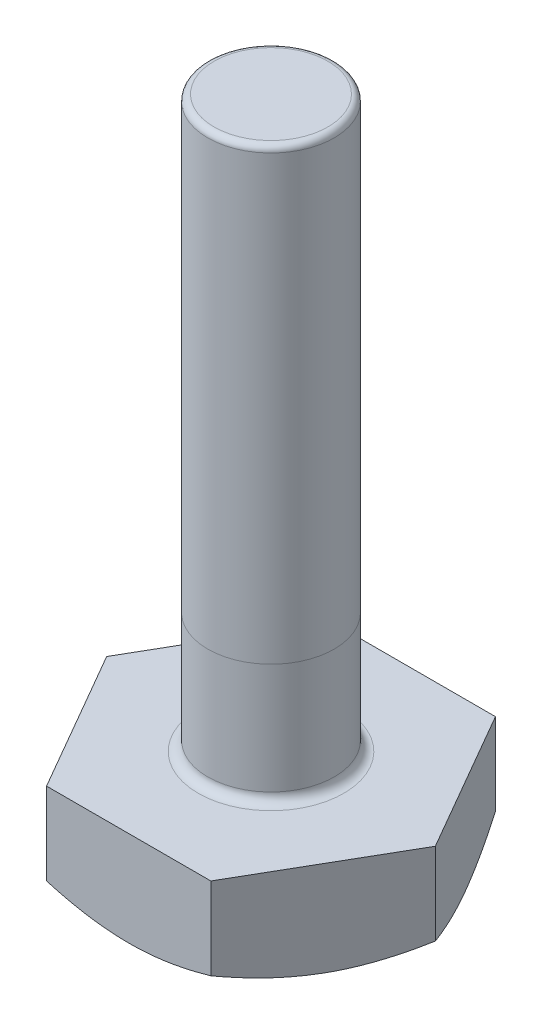
ISO-10303-21;
HEADER;
FILE_DESCRIPTION(('STEP AP214'),'2;1');
FILE_NAME('part.step','',(''),(''),'','','');
FILE_SCHEMA(('AUTOMOTIVE_DESIGN { 1 0 10303 214 1 1 1 1 }'));
ENDSEC;
DATA;
#1=APPLICATION_CONTEXT('core data for automotive mechanical design processes');
#2=APPLICATION_PROTOCOL_DEFINITION('international standard','automotive_design',2000,#1);
#3=PRODUCT_CONTEXT('',#1,'mechanical');
#4=PRODUCT('Part','Part','',(#3));
#5=PRODUCT_RELATED_PRODUCT_CATEGORY('part','',(#4));
#6=PRODUCT_DEFINITION_FORMATION('','',#4);
#7=PRODUCT_DEFINITION_CONTEXT('part definition',#1,'design');
#8=PRODUCT_DEFINITION('design','',#6,#7);
#9=PRODUCT_DEFINITION_SHAPE('','',#8);
#10=(LENGTH_UNIT() NAMED_UNIT(*) SI_UNIT(.MILLI.,.METRE.));
#11=(NAMED_UNIT(*) PLANE_ANGLE_UNIT() SI_UNIT($,.RADIAN.));
#12=(NAMED_UNIT(*) SI_UNIT($,.STERADIAN.) SOLID_ANGLE_UNIT());
#13=UNCERTAINTY_MEASURE_WITH_UNIT(LENGTH_MEASURE(1.E-05),#10,'distance_accuracy_value','');
#14=(GEOMETRIC_REPRESENTATION_CONTEXT(3) GLOBAL_UNCERTAINTY_ASSIGNED_CONTEXT((#13)) GLOBAL_UNIT_ASSIGNED_CONTEXT((#10,
#11,#12)) REPRESENTATION_CONTEXT('',''));
#15=CARTESIAN_POINT('',(0.,0.,0.));
#16=DIRECTION('',(0.,0.,1.));
#17=DIRECTION('',(1.,0.,0.));
#18=AXIS2_PLACEMENT_3D('',#15,#16,#17);
#19=CARTESIAN_POINT('',(0.,10.5,0.));
#20=DIRECTION('',(0.,-1.,0.));
#21=DIRECTION('',(0.,0.,-1.));
#22=AXIS2_PLACEMENT_3D('',#19,#20,#21);
#23=CYLINDRICAL_SURFACE('',#22,1.);
#24=CARTESIAN_POINT('',(0.,1.65,0.));
#25=DIRECTION('',(0.,1.,0.));
#26=DIRECTION('',(0.,0.,1.));
#27=AXIS2_PLACEMENT_3D('',#24,#25,#26);
#28=CIRCLE('',#27,1.);
#29=CARTESIAN_POINT('',(0.,1.65,1.));
#30=VERTEX_POINT('',#29);
#31=EDGE_CURVE('E265',#30,#30,#28,.T.);
#32=ORIENTED_EDGE('',*,*,#31,.T.);
#33=EDGE_LOOP('',(#32));
#34=FACE_BOUND('',#33,.T.);
#35=CARTESIAN_POINT('',(0.,3.4,0.));
#36=DIRECTION('',(0.,1.,0.));
#37=DIRECTION('',(0.,0.,1.));
#38=AXIS2_PLACEMENT_3D('',#35,#36,#37);
#39=CIRCLE('',#38,1.);
#40=CARTESIAN_POINT('',(0.,3.4,1.));
#41=VERTEX_POINT('',#40);
#42=EDGE_CURVE('E13',#41,#41,#39,.T.);
#43=ORIENTED_EDGE('',*,*,#42,.F.);
#44=EDGE_LOOP('',(#43));
#45=FACE_BOUND('',#44,.T.);
#46=ADVANCED_FACE('F59',(#34,#45),#23,.T.);
#47=CARTESIAN_POINT('',(1.29903810567666,1.5,2.25));
#48=DIRECTION('',(-0.866025403784439,0.,-0.5));
#49=DIRECTION('',(-0.5,0.,0.866025403784439));
#50=AXIS2_PLACEMENT_3D('',#47,#48,#49);
#51=PLANE('',#50);
#52=DIRECTION('',(0.,-1.,0.));
#53=VECTOR('',#52,1.);
#54=CARTESIAN_POINT('',(1.29903810567666,1.5,2.25));
#55=LINE('',#54,#53);
#56=CARTESIAN_POINT('',(1.29903810567666,1.5,2.25));
#57=VERTEX_POINT('',#56);
#58=CARTESIAN_POINT('',(1.29903810567666,0.200961894323341,2.25));
#59=VERTEX_POINT('',#58);
#60=EDGE_CURVE('E163',#57,#59,#55,.T.);
#61=ORIENTED_EDGE('',*,*,#60,.T.);
#62=CARTESIAN_POINT('',(1.29892263562282,0.201028565434254,2.2502));
#63=CARTESIAN_POINT('',(1.35600944184252,0.168055578047864,2.15132275118564));
#64=CARTESIAN_POINT('',(1.41358901625738,0.138067535415598,2.05159200282091));
#65=CARTESIAN_POINT('',(1.52974527574028,0.0857223882308779,1.85040345977937));
#66=CARTESIAN_POINT('',(1.58832402518513,0.0633838027064785,1.74894208949705));
#67=CARTESIAN_POINT('',(1.7047555284741,0.0286095576734187,1.54727681019892));
#68=CARTESIAN_POINT('',(1.76259036492223,0.0159424738337181,1.44710393502333));
#69=CARTESIAN_POINT('',(1.87853225689702,0.000818907417418704,1.24628668739732));
#70=CARTESIAN_POINT('',(1.93663889083104,-0.00165009697600156,1.1456430451668));
#71=CARTESIAN_POINT('',(2.04522012232352,0.00347837463602913,0.957574835473434));
#72=CARTESIAN_POINT('',(2.09571095029608,0.00981663451511996,0.870122156108741));
#73=CARTESIAN_POINT('',(2.19636364908279,0.0299076571898886,0.695786567891225));
#74=CARTESIAN_POINT('',(2.24652517159694,0.0436672872310833,0.608904262311711));
#75=CARTESIAN_POINT('',(2.34738550181938,0.0780662653506652,0.434209045898264));
#76=CARTESIAN_POINT('',(2.39807153998286,0.098851471582655,0.346418252564746));
#77=CARTESIAN_POINT('',(2.49868751999961,0.146026087362979,0.172146263122404));
#78=CARTESIAN_POINT('',(2.54861875151746,0.172404408014301,0.085662833248997));
#79=CARTESIAN_POINT('',(2.59819168140715,0.201028565434254,-0.000200000000000381));
#80=B_SPLINE_CURVE_WITH_KNOTS('',3,(#62,#63,#64,#65,#66,#67,#68,#69,#70,#71,#72,#73,#74,#75,#76,
#77,#78,#79),.UNSPECIFIED.,.F.,.F.,(4,2,2,2,2,2,2,2,4),(0.,0.356658826016552,0.714175103224236,
1.06284241804968,1.41108149062516,1.71433394539794,2.01786749258222,2.32813511279245,
2.63779325460359),.UNSPECIFIED.);
#81=CARTESIAN_POINT('',(1.94855715851499,0.,1.125));
#82=VERTEX_POINT('',#81);
#83=EDGE_CURVE('E82',#59,#82,#80,.T.);
#84=ORIENTED_EDGE('',*,*,#83,.T.);
#85=CARTESIAN_POINT('',(2.59807621135332,0.200961894323341,0.));
#86=VERTEX_POINT('',#85);
#87=EDGE_CURVE('E132',#82,#86,#80,.T.);
#88=ORIENTED_EDGE('',*,*,#87,.T.);
#89=DIRECTION('',(0.,-1.,0.));
#90=VECTOR('',#89,1.);
#91=CARTESIAN_POINT('',(2.59807621135332,1.5,0.));
#92=LINE('',#91,#90);
#93=CARTESIAN_POINT('',(2.59807621135332,1.5,0.));
#94=VERTEX_POINT('',#93);
#95=EDGE_CURVE('E157',#94,#86,#92,.T.);
#96=ORIENTED_EDGE('',*,*,#95,.F.);
#97=DIRECTION('',(0.5,0.,-0.866025403784439));
#98=VECTOR('',#97,1.);
#99=CARTESIAN_POINT('',(1.29903810567666,1.5,2.25));
#100=LINE('',#99,#98);
#101=EDGE_CURVE('E165',#57,#94,#100,.T.);
#102=ORIENTED_EDGE('',*,*,#101,.F.);
#103=EDGE_LOOP('',(#61,#84,#88,#96,#102));
#104=FACE_BOUND('',#103,.T.);
#105=ADVANCED_FACE('F160',(#104),#51,.F.);
#106=CARTESIAN_POINT('',(2.59807621135332,1.5,0.));
#107=DIRECTION('',(-0.866025403784439,0.,0.5));
#108=DIRECTION('',(0.5,0.,0.866025403784439));
#109=AXIS2_PLACEMENT_3D('',#106,#107,#108);
#110=PLANE('',#109);
#111=ORIENTED_EDGE('',*,*,#95,.T.);
#112=CARTESIAN_POINT('',(2.59819168140715,0.201028565434254,0.000199999999999357));
#113=CARTESIAN_POINT('',(2.54110487518745,0.168055578047863,-0.098677248814358));
#114=CARTESIAN_POINT('',(2.48352530077259,0.138067535415598,-0.198407997179094));
#115=CARTESIAN_POINT('',(2.36736904128969,0.0857223882308776,-0.399596540220633));
#116=CARTESIAN_POINT('',(2.30879029184485,0.0633838027064784,-0.501057910502946));
#117=CARTESIAN_POINT('',(2.19235878855587,0.0286095576734187,-0.702723189801079));
#118=CARTESIAN_POINT('',(2.13452395210774,0.0159424738337182,-0.802896064976672));
#119=CARTESIAN_POINT('',(2.01858206013295,0.000818907417418827,-1.00371331260268));
#120=CARTESIAN_POINT('',(1.96047542619893,-0.00165009697600156,-1.1043569548332));
#121=CARTESIAN_POINT('',(1.85189419470646,0.00347837463602913,-1.29242516452657));
#122=CARTESIAN_POINT('',(1.8014033667339,0.00981663451512006,-1.37987784389126));
#123=CARTESIAN_POINT('',(1.70075066794718,0.0299076571898888,-1.55421343210877));
#124=CARTESIAN_POINT('',(1.65058914543304,0.0436672872310834,-1.64109573768829));
#125=CARTESIAN_POINT('',(1.54972881521059,0.0780662653506654,-1.81579095410174));
#126=CARTESIAN_POINT('',(1.49904277704711,0.0988514715826554,-1.90358174743525));
#127=CARTESIAN_POINT('',(1.39842679703037,0.146026087362979,-2.07785373687759));
#128=CARTESIAN_POINT('',(1.34849556551251,0.172404408014302,-2.164337166751));
#129=CARTESIAN_POINT('',(1.29892263562282,0.201028565434254,-2.2502));
#130=B_SPLINE_CURVE_WITH_KNOTS('',3,(#112,#113,#114,#115,#116,#117,#118,#119,#120,#121,#122,
#123,#124,#125,#126,#127,#128,#129),.UNSPECIFIED.,.F.,.F.,(4,2,2,2,2,2,2,2,4),(0.,
0.356658826016552,0.714175103224236,1.06284241804968,1.41108149062516,1.71433394539794,
2.01786749258222,2.32813511279245,2.63779325460359),.UNSPECIFIED.);
#131=CARTESIAN_POINT('',(1.94855715851499,0.,-1.125));
#132=VERTEX_POINT('',#131);
#133=EDGE_CURVE('E138',#86,#132,#130,.T.);
#134=ORIENTED_EDGE('',*,*,#133,.T.);
#135=CARTESIAN_POINT('',(1.29903810567666,0.200961894323341,-2.25));
#136=VERTEX_POINT('',#135);
#137=EDGE_CURVE('E177',#132,#136,#130,.T.);
#138=ORIENTED_EDGE('',*,*,#137,.T.);
#139=DIRECTION('',(0.,-1.,0.));
#140=VECTOR('',#139,1.);
#141=CARTESIAN_POINT('',(1.29903810567666,1.5,-2.25));
#142=LINE('',#141,#140);
#143=CARTESIAN_POINT('',(1.29903810567666,1.5,-2.25));
#144=VERTEX_POINT('',#143);
#145=EDGE_CURVE('E405',#144,#136,#142,.T.);
#146=ORIENTED_EDGE('',*,*,#145,.F.);
#147=DIRECTION('',(-0.5,0.,-0.866025403784438));
#148=VECTOR('',#147,1.);
#149=CARTESIAN_POINT('',(2.59807621135332,1.5,0.));
#150=LINE('',#149,#148);
#151=EDGE_CURVE('E168',#94,#144,#150,.T.);
#152=ORIENTED_EDGE('',*,*,#151,.F.);
#153=EDGE_LOOP('',(#111,#134,#138,#146,#152));
#154=FACE_BOUND('',#153,.T.);
#155=ADVANCED_FACE('F234',(#154),#110,.F.);
#156=CARTESIAN_POINT('',(1.29903810567666,1.5,-2.25));
#157=DIRECTION('',(0.,0.,1.));
#158=DIRECTION('',(1.,0.,0.));
#159=AXIS2_PLACEMENT_3D('',#156,#157,#158);
#160=PLANE('',#159);
#161=ORIENTED_EDGE('',*,*,#145,.T.);
#162=CARTESIAN_POINT('',(-3.52197738141251,1.11390095110183,-2.25));
#163=CARTESIAN_POINT('',(-3.42341375827664,1.0659585756218,-2.25));
#164=CARTESIAN_POINT('',(-3.32462732046674,1.01846660292519,-2.25));
#165=CARTESIAN_POINT('',(-3.12649042155675,0.924636184761063,-2.25));
#166=CARTESIAN_POINT('',(-3.0271398773449,0.878297914989038,-2.25));
#167=CARTESIAN_POINT('',(-2.82726011968439,0.786801502375653,-2.25));
#168=CARTESIAN_POINT('',(-2.72672745294232,0.741650877991985,-2.25));
#169=CARTESIAN_POINT('',(-2.52487369382336,0.653154685540231,-2.25));
#170=CARTESIAN_POINT('',(-2.42355263804854,0.609809034260195,-2.25));
#171=CARTESIAN_POINT('',(-2.21659476271895,0.524002667690954,-2.25));
#172=CARTESIAN_POINT('',(-2.11092600192723,0.48161857996588,-2.25));
#173=CARTESIAN_POINT('',(-1.89836438450428,0.39997997327036,-2.25));
#174=CARTESIAN_POINT('',(-1.79147139383765,0.360725800799589,-2.25));
#175=CARTESIAN_POINT('',(-1.57648088714343,0.286353481784259,-2.25));
#176=CARTESIAN_POINT('',(-1.46838619801085,0.251227243931005,-2.25));
#177=CARTESIAN_POINT('',(-1.25064660418042,0.186216235284175,-2.25));
#178=CARTESIAN_POINT('',(-1.14100218878383,0.156329848348454,-2.25));
#179=CARTESIAN_POINT('',(-0.92070201849629,0.103368352938566,-2.25));
#180=CARTESIAN_POINT('',(-0.810055393150088,0.0802559587867579,-2.25));
#181=CARTESIAN_POINT('',(-0.587352764653864,0.0421303854829852,-2.25));
#182=CARTESIAN_POINT('',(-0.47529691042668,0.027116357759959,-2.25));
#183=CARTESIAN_POINT('',(-0.251812929194183,0.00658034974223085,-2.25));
#184=CARTESIAN_POINT('',(-0.14039654239679,0.000933753367218394,-2.25));
#185=CARTESIAN_POINT('',(0.0825190683366311,-0.000718872330041224,-2.25));
#186=CARTESIAN_POINT('',(0.194018293833792,0.00327528488856826,-2.25));
#187=CARTESIAN_POINT('',(0.382330142880849,0.0178769534924864,-2.25));
#188=CARTESIAN_POINT('',(0.459340397363023,0.0260932396846655,-2.25));
#189=CARTESIAN_POINT('',(0.612816753345091,0.0466307384415177,-2.25));
#190=CARTESIAN_POINT('',(0.689282783381976,0.0589524803012809,-2.25));
#191=CARTESIAN_POINT('',(0.917739348520181,0.101432117313602,-2.25));
#192=CARTESIAN_POINT('',(1.06870971539403,0.137097502133778,-2.25));
#193=CARTESIAN_POINT('',(1.37103680360794,0.220180172187129,-2.25));
#194=CARTESIAN_POINT('',(1.52232103264969,0.267851205926124,-2.25));
#195=CARTESIAN_POINT('',(1.74714070039569,0.345287132446791,-2.25));
#196=CARTESIAN_POINT('',(1.82172326340421,0.372084822292635,-2.25));
#197=CARTESIAN_POINT('',(1.97026726128439,0.427347472066698,-2.25));
#198=CARTESIAN_POINT('',(2.04422870882023,0.455812397906081,-2.25));
#199=CARTESIAN_POINT('',(2.23860492044926,0.53272916106023,-2.25));
#200=CARTESIAN_POINT('',(2.35855685866881,0.582348052655542,-2.25));
#201=CARTESIAN_POINT('',(2.59726926616986,0.684383302621109,-2.25));
#202=CARTESIAN_POINT('',(2.71602961917634,0.736799930900864,-2.25));
#203=CARTESIAN_POINT('',(2.95261997022605,0.843783458085284,-2.25));
#204=CARTESIAN_POINT('',(3.07044966156159,0.898351033044894,-2.25));
#205=CARTESIAN_POINT('',(3.30532803773282,1.00914490838146,-2.25));
#206=CARTESIAN_POINT('',(3.42237670029077,1.06537125582663,-2.25));
#207=CARTESIAN_POINT('',(3.772918226205,1.23615148283883,-2.25));
#208=CARTESIAN_POINT('',(4.00546324926994,1.35264855901626,-2.25));
#209=CARTESIAN_POINT('',(4.46880936717424,1.58892913990386,-2.25));
#210=CARTESIAN_POINT('',(4.69961078337091,1.70871201919371,-2.25));
#211=CARTESIAN_POINT('',(5.13664821519431,1.93826026257468,-2.25));
#212=CARTESIAN_POINT('',(5.34299887018508,2.04780774589485,-2.25));
#213=CARTESIAN_POINT('',(5.75499613846858,2.26824392733038,-2.25));
#214=CARTESIAN_POINT('',(5.96064271189639,2.37913269982908,-2.25));
#215=CARTESIAN_POINT('',(6.37074349624387,2.60155716847679,-2.25));
#216=CARTESIAN_POINT('',(6.57519942113759,2.71308970822725,-2.25));
#217=CARTESIAN_POINT('',(6.98367055464051,2.93692385932281,-2.25));
#218=CARTESIAN_POINT('',(7.18768579443994,3.04922541372586,-2.25));
#219=CARTESIAN_POINT('',(7.39154490642063,3.16180770738138,-2.25));
#220=B_SPLINE_CURVE_WITH_KNOTS('',3,(#162,#163,#164,#165,#166,#167,#168,#169,#170,#171,#172,
#173,#174,#175,#176,#177,#178,#179,#180,#181,#182,#183,#184,#185,#186,#187,#188,#189,#190,#191,
#192,#193,#194,#195,#196,#197,#198,#199,#200,#201,#202,#203,#204,#205,#206,#207,#208,#209,#210,
#211,#212,#213,#214,#215,#216,#217,#218,#219),.UNSPECIFIED.,.F.,.F.,(4,2,2,2,2,2,2,2,2,2,2,2,2,
2,2,2,2,2,2,2,2,2,2,2,2,2,2,2,4),(0.,0.328818908084942,0.657687588893984,0.988291819795509,
1.31888079243726,1.66039871580695,2.00195439483825,2.34282899905692,2.68359828068235,
3.02245505769599,3.36127632138179,3.69555296053218,4.02983606771951,4.26206695892987,
4.49432780205634,4.95908522051656,5.43463886514895,5.67237551107399,5.91010729785594,
6.29948456778213,6.68889947071941,7.07843776050616,7.46798711422164,8.24821946544531,
9.02830432372208,9.72917646139023,10.4300876468841,11.1287814424384,11.8274240505439),.UNSPECIFIED.);
#221=CARTESIAN_POINT('',(0.,0.,-2.25));
#222=VERTEX_POINT('',#221);
#223=EDGE_CURVE('E228',#136,#222,#220,.F.);
#224=ORIENTED_EDGE('',*,*,#223,.T.);
#225=CARTESIAN_POINT('',(-1.29903810567666,0.200961894323341,-2.25));
#226=VERTEX_POINT('',#225);
#227=EDGE_CURVE('E220',#222,#226,#220,.F.);
#228=ORIENTED_EDGE('',*,*,#227,.T.);
#229=DIRECTION('',(0.,-1.,0.));
#230=VECTOR('',#229,1.);
#231=CARTESIAN_POINT('',(-1.29903810567666,1.5,-2.25));
#232=LINE('',#231,#230);
#233=CARTESIAN_POINT('',(-1.29903810567666,1.5,-2.25));
#234=VERTEX_POINT('',#233);
#235=EDGE_CURVE('E399',#234,#226,#232,.T.);
#236=ORIENTED_EDGE('',*,*,#235,.F.);
#237=DIRECTION('',(-1.,0.,0.));
#238=VECTOR('',#237,1.);
#239=CARTESIAN_POINT('',(1.29903810567666,1.5,-2.25));
#240=LINE('',#239,#238);
#241=EDGE_CURVE('E450',#144,#234,#240,.T.);
#242=ORIENTED_EDGE('',*,*,#241,.F.);
#243=EDGE_LOOP('',(#161,#224,#228,#236,#242));
#244=FACE_BOUND('',#243,.T.);
#245=ADVANCED_FACE('F230',(#244),#160,.F.);
#246=CARTESIAN_POINT('',(-1.29903810567666,1.5,-2.25));
#247=DIRECTION('',(0.866025403784439,0.,0.5));
#248=DIRECTION('',(0.5,0.,-0.866025403784439));
#249=AXIS2_PLACEMENT_3D('',#246,#247,#248);
#250=PLANE('',#249);
#251=ORIENTED_EDGE('',*,*,#235,.T.);
#252=CARTESIAN_POINT('',(-1.29892263562282,0.201028565434254,-2.2502));
#253=CARTESIAN_POINT('',(-1.35600944184252,0.168055578047864,-2.15132275118564));
#254=CARTESIAN_POINT('',(-1.41358901625738,0.138067535415598,-2.05159200282091));
#255=CARTESIAN_POINT('',(-1.52974527574028,0.0857223882308779,-1.85040345977937));
#256=CARTESIAN_POINT('',(-1.58832402518513,0.0633838027064784,-1.74894208949705));
#257=CARTESIAN_POINT('',(-1.7047555284741,0.0286095576734186,-1.54727681019892));
#258=CARTESIAN_POINT('',(-1.76259036492223,0.0159424738337182,-1.44710393502333));
#259=CARTESIAN_POINT('',(-1.87853225689702,0.000818907417418833,-1.24628668739732));
#260=CARTESIAN_POINT('',(-1.93663889083104,-0.00165009697600149,-1.1456430451668));
#261=CARTESIAN_POINT('',(-2.04522012232352,0.00347837463602918,-0.957574835473435));
#262=CARTESIAN_POINT('',(-2.09571095029608,0.00981663451512005,-0.870122156108742));
#263=CARTESIAN_POINT('',(-2.19636364908279,0.0299076571898888,-0.695786567891226));
#264=CARTESIAN_POINT('',(-2.24652517159694,0.0436672872310835,-0.608904262311712));
#265=CARTESIAN_POINT('',(-2.34738550181938,0.0780662653506654,-0.434209045898264));
#266=CARTESIAN_POINT('',(-2.39807153998286,0.0988514715826553,-0.346418252564746));
#267=CARTESIAN_POINT('',(-2.49868751999961,0.146026087362979,-0.172146263122405));
#268=CARTESIAN_POINT('',(-2.54861875151746,0.172404408014302,-0.0856628332489976));
#269=CARTESIAN_POINT('',(-2.59819168140715,0.201028565434255,0.000200000000000257));
#270=B_SPLINE_CURVE_WITH_KNOTS('',3,(#252,#253,#254,#255,#256,#257,#258,#259,#260,#261,#262,
#263,#264,#265,#266,#267,#268,#269),.UNSPECIFIED.,.F.,.F.,(4,2,2,2,2,2,2,2,4),(0.,
0.356658826016552,0.714175103224236,1.06284241804968,1.41108149062516,1.71433394539794,
2.01786749258222,2.32813511279245,2.63779325460359),.UNSPECIFIED.);
#271=CARTESIAN_POINT('',(-1.94855715851499,0.,-1.125));
#272=VERTEX_POINT('',#271);
#273=EDGE_CURVE('E229',#226,#272,#270,.T.);
#274=ORIENTED_EDGE('',*,*,#273,.T.);
#275=CARTESIAN_POINT('',(-2.59807621135332,0.200961894323341,0.));
#276=VERTEX_POINT('',#275);
#277=EDGE_CURVE('E214',#272,#276,#270,.T.);
#278=ORIENTED_EDGE('',*,*,#277,.T.);
#279=DIRECTION('',(0.,-1.,0.));
#280=VECTOR('',#279,1.);
#281=CARTESIAN_POINT('',(-2.59807621135332,1.5,0.));
#282=LINE('',#281,#280);
#283=CARTESIAN_POINT('',(-2.59807621135332,1.5,0.));
#284=VERTEX_POINT('',#283);
#285=EDGE_CURVE('E406',#284,#276,#282,.T.);
#286=ORIENTED_EDGE('',*,*,#285,.F.);
#287=DIRECTION('',(-0.5,0.,0.866025403784439));
#288=VECTOR('',#287,1.);
#289=CARTESIAN_POINT('',(-1.29903810567666,1.5,-2.25));
#290=LINE('',#289,#288);
#291=EDGE_CURVE('E402',#234,#284,#290,.T.);
#292=ORIENTED_EDGE('',*,*,#291,.F.);
#293=EDGE_LOOP('',(#251,#274,#278,#286,#292));
#294=FACE_BOUND('',#293,.T.);
#295=ADVANCED_FACE('F233',(#294),#250,.F.);
#296=CARTESIAN_POINT('',(-2.59807621135332,1.5,0.));
#297=DIRECTION('',(0.866025403784439,0.,-0.5));
#298=DIRECTION('',(-0.5,0.,-0.866025403784439));
#299=AXIS2_PLACEMENT_3D('',#296,#297,#298);
#300=PLANE('',#299);
#301=ORIENTED_EDGE('',*,*,#285,.T.);
#302=CARTESIAN_POINT('',(-2.59819168140715,0.201028565434254,-0.000199999999999883));
#303=CARTESIAN_POINT('',(-2.54110487518745,0.168055578047863,0.0986772488143573));
#304=CARTESIAN_POINT('',(-2.48352530077259,0.138067535415598,0.198407997179094));
#305=CARTESIAN_POINT('',(-2.36736904128969,0.0857223882308777,0.399596540220633));
#306=CARTESIAN_POINT('',(-2.30879029184485,0.0633838027064785,0.501057910502946));
#307=CARTESIAN_POINT('',(-2.19235878855587,0.0286095576734187,0.702723189801079));
#308=CARTESIAN_POINT('',(-2.13452395210774,0.0159424738337181,0.802896064976672));
#309=CARTESIAN_POINT('',(-2.01858206013295,0.00081890741741856,1.00371331260268));
#310=CARTESIAN_POINT('',(-1.96047542619893,-0.00165009697600183,1.1043569548332));
#311=CARTESIAN_POINT('',(-1.85189419470646,0.00347837463602913,1.29242516452657));
#312=CARTESIAN_POINT('',(-1.8014033667339,0.00981663451512028,1.37987784389126));
#313=CARTESIAN_POINT('',(-1.70075066794718,0.029907657189889,1.55421343210877));
#314=CARTESIAN_POINT('',(-1.65058914543304,0.0436672872310835,1.64109573768829));
#315=CARTESIAN_POINT('',(-1.54972881521059,0.0780662653506653,1.81579095410174));
#316=CARTESIAN_POINT('',(-1.49904277704711,0.0988514715826554,1.90358174743525));
#317=CARTESIAN_POINT('',(-1.39842679703037,0.146026087362979,2.0778537368776));
#318=CARTESIAN_POINT('',(-1.34849556551251,0.172404408014302,2.164337166751));
#319=CARTESIAN_POINT('',(-1.29892263562282,0.201028565434254,2.2502));
#320=B_SPLINE_CURVE_WITH_KNOTS('',3,(#302,#303,#304,#305,#306,#307,#308,#309,#310,#311,#312,
#313,#314,#315,#316,#317,#318,#319),.UNSPECIFIED.,.F.,.F.,(4,2,2,2,2,2,2,2,4),(0.,
0.356658826016552,0.714175103224236,1.06284241804968,1.41108149062516,1.71433394539794,
2.01786749258222,2.32813511279245,2.63779325460359),.UNSPECIFIED.);
#321=CARTESIAN_POINT('',(-1.94855715851499,0.,1.125));
#322=VERTEX_POINT('',#321);
#323=EDGE_CURVE('E458',#276,#322,#320,.T.);
#324=ORIENTED_EDGE('',*,*,#323,.T.);
#325=CARTESIAN_POINT('',(-1.29903810567683,0.200961894323226,2.25));
#326=VERTEX_POINT('',#325);
#327=EDGE_CURVE('E207',#322,#326,#320,.T.);
#328=ORIENTED_EDGE('',*,*,#327,.T.);
#329=DIRECTION('',(0.,-1.,0.));
#330=VECTOR('',#329,1.);
#331=CARTESIAN_POINT('',(-1.29903810567666,1.5,2.25));
#332=LINE('',#331,#330);
#333=CARTESIAN_POINT('',(-1.29903810567666,1.5,2.25));
#334=VERTEX_POINT('',#333);
#335=EDGE_CURVE('E413',#334,#326,#332,.T.);
#336=ORIENTED_EDGE('',*,*,#335,.F.);
#337=DIRECTION('',(0.5,0.,0.866025403784439));
#338=VECTOR('',#337,1.);
#339=CARTESIAN_POINT('',(-2.59807621135332,1.5,0.));
#340=LINE('',#339,#338);
#341=EDGE_CURVE('E437',#284,#334,#340,.T.);
#342=ORIENTED_EDGE('',*,*,#341,.F.);
#343=EDGE_LOOP('',(#301,#324,#328,#336,#342));
#344=FACE_BOUND('',#343,.T.);
#345=ADVANCED_FACE('F359',(#344),#300,.F.);
#346=CARTESIAN_POINT('',(-1.29903810567666,1.5,2.25));
#347=DIRECTION('',(0.,0.,-1.));
#348=DIRECTION('',(-1.,0.,0.));
#349=AXIS2_PLACEMENT_3D('',#346,#347,#348);
#350=PLANE('',#349);
#351=ORIENTED_EDGE('',*,*,#335,.T.);
#352=CARTESIAN_POINT('',(-3.5219773814125,1.11390095110183,2.25));
#353=CARTESIAN_POINT('',(-3.42341375827664,1.0659585756218,2.25));
#354=CARTESIAN_POINT('',(-3.32462732046674,1.01846660292519,2.25));
#355=CARTESIAN_POINT('',(-3.12649042155674,0.924636184761063,2.25));
#356=CARTESIAN_POINT('',(-3.02713987734489,0.878297914989037,2.25));
#357=CARTESIAN_POINT('',(-2.82726011968439,0.786801502375653,2.25));
#358=CARTESIAN_POINT('',(-2.72672745294232,0.741650877991985,2.25));
#359=CARTESIAN_POINT('',(-2.52487369382336,0.65315468554023,2.25));
#360=CARTESIAN_POINT('',(-2.42355263804854,0.609809034260194,2.25));
#361=CARTESIAN_POINT('',(-2.21659476271895,0.524002667690954,2.25));
#362=CARTESIAN_POINT('',(-2.11092600192723,0.48161857996588,2.25));
#363=CARTESIAN_POINT('',(-1.89836438450428,0.39997997327036,2.25));
#364=CARTESIAN_POINT('',(-1.79147139383765,0.360725800799589,2.25));
#365=CARTESIAN_POINT('',(-1.57648088714343,0.286353481784258,2.25));
#366=CARTESIAN_POINT('',(-1.46838619801085,0.251227243931004,2.25));
#367=CARTESIAN_POINT('',(-1.25064660418042,0.186216235284175,2.25));
#368=CARTESIAN_POINT('',(-1.14100218878383,0.156329848348454,2.25));
#369=CARTESIAN_POINT('',(-0.92070201849629,0.103368352938566,2.25));
#370=CARTESIAN_POINT('',(-0.810055393150088,0.0802559587867576,2.25));
#371=CARTESIAN_POINT('',(-0.587352764653863,0.042130385482985,2.25));
#372=CARTESIAN_POINT('',(-0.47529691042668,0.027116357759959,2.25));
#373=CARTESIAN_POINT('',(-0.251812929194182,0.00658034974223091,2.25));
#374=CARTESIAN_POINT('',(-0.14039654239679,0.00093375336721839,2.25));
#375=CARTESIAN_POINT('',(0.0825190683366311,-0.00071887233004122,2.25));
#376=CARTESIAN_POINT('',(0.194018293833792,0.00327528488856833,2.25));
#377=CARTESIAN_POINT('',(0.382330142880849,0.0178769534924863,2.25));
#378=CARTESIAN_POINT('',(0.459340397363022,0.0260932396846652,2.25));
#379=CARTESIAN_POINT('',(0.61281675334509,0.0466307384415174,2.25));
#380=CARTESIAN_POINT('',(0.689282783381975,0.0589524803012808,2.25));
#381=CARTESIAN_POINT('',(0.91773934852018,0.101432117313602,2.25));
#382=CARTESIAN_POINT('',(1.06870971539403,0.137097502133778,2.25));
#383=CARTESIAN_POINT('',(1.37103680360795,0.220180172187129,2.25));
#384=CARTESIAN_POINT('',(1.52232103264969,0.267851205926124,2.25));
#385=CARTESIAN_POINT('',(1.74714070039569,0.345287132446791,2.25));
#386=CARTESIAN_POINT('',(1.82172326340421,0.372084822292635,2.25));
#387=CARTESIAN_POINT('',(1.97026726128439,0.427347472066698,2.25));
#388=CARTESIAN_POINT('',(2.04422870882023,0.455812397906081,2.25));
#389=CARTESIAN_POINT('',(2.23860492044926,0.53272916106023,2.25));
#390=CARTESIAN_POINT('',(2.35855685866881,0.582348052655542,2.25));
#391=CARTESIAN_POINT('',(2.59726926616986,0.684383302621109,2.25));
#392=CARTESIAN_POINT('',(2.71602961917634,0.736799930900865,2.25));
#393=CARTESIAN_POINT('',(2.95261997022605,0.843783458085285,2.25));
#394=CARTESIAN_POINT('',(3.07044966156159,0.898351033044895,2.25));
#395=CARTESIAN_POINT('',(3.30532803773282,1.00914490838146,2.25));
#396=CARTESIAN_POINT('',(3.42237670029077,1.06537125582663,2.25));
#397=CARTESIAN_POINT('',(3.772918226205,1.23615148283883,2.25));
#398=CARTESIAN_POINT('',(4.00546324926994,1.35264855901626,2.25));
#399=CARTESIAN_POINT('',(4.46880936717424,1.58892913990386,2.25));
#400=CARTESIAN_POINT('',(4.69961078337092,1.70871201919371,2.25));
#401=CARTESIAN_POINT('',(5.13664821519431,1.93826026257468,2.25));
#402=CARTESIAN_POINT('',(5.34299887018508,2.04780774589485,2.25));
#403=CARTESIAN_POINT('',(5.75499613846858,2.26824392733038,2.25));
#404=CARTESIAN_POINT('',(5.96064271189639,2.37913269982908,2.25));
#405=CARTESIAN_POINT('',(6.37074349624388,2.60155716847679,2.25));
#406=CARTESIAN_POINT('',(6.57519942113759,2.71308970822725,2.25));
#407=CARTESIAN_POINT('',(6.98367055464051,2.93692385932282,2.25));
#408=CARTESIAN_POINT('',(7.18768579443994,3.04922541372586,2.25));
#409=CARTESIAN_POINT('',(7.39154490642063,3.16180770738138,2.25));
#410=B_SPLINE_CURVE_WITH_KNOTS('',3,(#352,#353,#354,#355,#356,#357,#358,#359,#360,#361,#362,
#363,#364,#365,#366,#367,#368,#369,#370,#371,#372,#373,#374,#375,#376,#377,#378,#379,#380,#381,
#382,#383,#384,#385,#386,#387,#388,#389,#390,#391,#392,#393,#394,#395,#396,#397,#398,#399,#400,
#401,#402,#403,#404,#405,#406,#407,#408,#409),.UNSPECIFIED.,.F.,.F.,(4,2,2,2,2,2,2,2,2,2,2,2,2,
2,2,2,2,2,2,2,2,2,2,2,2,2,2,2,4),(0.,0.328818908084942,0.657687588893984,0.988291819795508,
1.31888079243726,1.66039871580695,2.00195439483825,2.34282899905692,2.68359828068235,
3.02245505769599,3.36127632138179,3.69555296053217,4.02983606771951,4.26206695892987,
4.49432780205634,4.95908522051656,5.43463886514895,5.67237551107399,5.91010729785594,
6.29948456778212,6.68889947071941,7.07843776050616,7.46798711422164,8.24821946544531,
9.02830432372209,9.72917646139023,10.4300876468841,11.1287814424384,11.8274240505439),.UNSPECIFIED.);
#411=CARTESIAN_POINT('',(0.,0.,2.25));
#412=VERTEX_POINT('',#411);
#413=EDGE_CURVE('E454',#326,#412,#410,.T.);
#414=ORIENTED_EDGE('',*,*,#413,.T.);
#415=EDGE_CURVE('E147',#412,#59,#410,.T.);
#416=ORIENTED_EDGE('',*,*,#415,.T.);
#417=ORIENTED_EDGE('',*,*,#60,.F.);
#418=DIRECTION('',(1.,0.,0.));
#419=VECTOR('',#418,1.);
#420=CARTESIAN_POINT('',(-1.29903810567666,1.5,2.25));
#421=LINE('',#420,#419);
#422=EDGE_CURVE('E435',#334,#57,#421,.T.);
#423=ORIENTED_EDGE('',*,*,#422,.F.);
#424=EDGE_LOOP('',(#351,#414,#416,#417,#423));
#425=FACE_BOUND('',#424,.T.);
#426=ADVANCED_FACE('F354',(#425),#350,.F.);
#427=CARTESIAN_POINT('',(0.,1.5,0.));
#428=DIRECTION('',(0.,1.,0.));
#429=DIRECTION('',(0.,0.,1.));
#430=AXIS2_PLACEMENT_3D('',#427,#428,#429);
#431=PLANE('',#430);
#432=CARTESIAN_POINT('',(0.,1.5,0.));
#433=DIRECTION('',(0.,1.,0.));
#434=DIRECTION('',(0.,0.,1.));
#435=AXIS2_PLACEMENT_3D('',#432,#433,#434);
#436=CIRCLE('',#435,1.15);
#437=CARTESIAN_POINT('',(0.,1.5,1.15));
#438=VERTEX_POINT('',#437);
#439=EDGE_CURVE('E68',#438,#438,#436,.F.);
#440=ORIENTED_EDGE('',*,*,#439,.T.);
#441=EDGE_LOOP('',(#440));
#442=FACE_BOUND('',#441,.T.);
#443=ORIENTED_EDGE('',*,*,#101,.T.);
#444=ORIENTED_EDGE('',*,*,#151,.T.);
#445=ORIENTED_EDGE('',*,*,#241,.T.);
#446=ORIENTED_EDGE('',*,*,#291,.T.);
#447=ORIENTED_EDGE('',*,*,#341,.T.);
#448=ORIENTED_EDGE('',*,*,#422,.T.);
#449=EDGE_LOOP('',(#443,#444,#445,#446,#447,#448));
#450=FACE_BOUND('',#449,.T.);
#451=ADVANCED_FACE('F190',(#442,#450),#431,.T.);
#452=CARTESIAN_POINT('',(0.,0.,0.));
#453=DIRECTION('',(0.,1.,0.));
#454=DIRECTION('',(0.,0.,1.));
#455=AXIS2_PLACEMENT_3D('',#452,#453,#454);
#456=CONICAL_SURFACE('',#455,2.25,1.0471975511966);
#457=ORIENTED_EDGE('',*,*,#415,.F.);
#458=CARTESIAN_POINT('',(0.,0.,0.));
#459=DIRECTION('',(0.,1.,0.));
#460=DIRECTION('',(0.,0.,1.));
#461=AXIS2_PLACEMENT_3D('',#458,#459,#460);
#462=CIRCLE('',#461,2.25);
#463=EDGE_CURVE('E145',#412,#82,#462,.T.);
#464=ORIENTED_EDGE('',*,*,#463,.T.);
#465=ORIENTED_EDGE('',*,*,#83,.F.);
#466=EDGE_LOOP('',(#457,#464,#465));
#467=FACE_BOUND('',#466,.T.);
#468=ADVANCED_FACE('F146',(#467),#456,.T.);
#469=CARTESIAN_POINT('',(0.,0.,0.));
#470=DIRECTION('',(0.,1.,0.));
#471=DIRECTION('',(0.,0.,1.));
#472=AXIS2_PLACEMENT_3D('',#469,#470,#471);
#473=CIRCLE('',#472,2.25);
#474=EDGE_CURVE('E135',#132,#82,#473,.F.);
#475=ORIENTED_EDGE('',*,*,#474,.F.);
#476=ORIENTED_EDGE('',*,*,#133,.F.);
#477=ORIENTED_EDGE('',*,*,#87,.F.);
#478=EDGE_LOOP('',(#475,#476,#477));
#479=FACE_BOUND('',#478,.T.);
#480=ADVANCED_FACE('F133',(#479),#456,.T.);
#481=EDGE_CURVE('E155',#222,#132,#473,.F.);
#482=ORIENTED_EDGE('',*,*,#481,.F.);
#483=ORIENTED_EDGE('',*,*,#223,.F.);
#484=ORIENTED_EDGE('',*,*,#137,.F.);
#485=EDGE_LOOP('',(#482,#483,#484));
#486=FACE_BOUND('',#485,.T.);
#487=ADVANCED_FACE('F328',(#486),#456,.T.);
#488=EDGE_CURVE('E423',#272,#222,#473,.F.);
#489=ORIENTED_EDGE('',*,*,#488,.F.);
#490=ORIENTED_EDGE('',*,*,#273,.F.);
#491=ORIENTED_EDGE('',*,*,#227,.F.);
#492=EDGE_LOOP('',(#489,#490,#491));
#493=FACE_BOUND('',#492,.T.);
#494=ADVANCED_FACE('F319',(#493),#456,.T.);
#495=EDGE_CURVE('E419',#322,#272,#473,.F.);
#496=ORIENTED_EDGE('',*,*,#495,.F.);
#497=ORIENTED_EDGE('',*,*,#323,.F.);
#498=ORIENTED_EDGE('',*,*,#277,.F.);
#499=EDGE_LOOP('',(#496,#497,#498));
#500=FACE_BOUND('',#499,.T.);
#501=ADVANCED_FACE('F311',(#500),#456,.T.);
#502=EDGE_CURVE('E75',#412,#322,#473,.F.);
#503=ORIENTED_EDGE('',*,*,#502,.F.);
#504=ORIENTED_EDGE('',*,*,#413,.F.);
#505=ORIENTED_EDGE('',*,*,#327,.F.);
#506=EDGE_LOOP('',(#503,#504,#505));
#507=FACE_BOUND('',#506,.T.);
#508=ADVANCED_FACE('F191',(#507),#456,.T.);
#509=CARTESIAN_POINT('',(0.,0.,0.));
#510=DIRECTION('',(0.,1.,0.));
#511=DIRECTION('',(0.,0.,1.));
#512=AXIS2_PLACEMENT_3D('',#509,#510,#511);
#513=PLANE('',#512);
#514=ORIENTED_EDGE('',*,*,#463,.F.);
#515=ORIENTED_EDGE('',*,*,#502,.T.);
#516=ORIENTED_EDGE('',*,*,#495,.T.);
#517=ORIENTED_EDGE('',*,*,#488,.T.);
#518=ORIENTED_EDGE('',*,*,#481,.T.);
#519=ORIENTED_EDGE('',*,*,#474,.T.);
#520=EDGE_LOOP('',(#514,#515,#516,#517,#518,#519));
#521=FACE_BOUND('',#520,.T.);
#522=ADVANCED_FACE('F152',(#521),#513,.F.);
#523=ORIENTED_EDGE('',*,*,#42,.T.);
#524=EDGE_LOOP('',(#523));
#525=FACE_BOUND('',#524,.T.);
#526=CARTESIAN_POINT('',(0.,10.4,0.));
#527=DIRECTION('',(0.,1.,0.));
#528=DIRECTION('',(0.,0.,1.));
#529=AXIS2_PLACEMENT_3D('',#526,#527,#528);
#530=CIRCLE('',#529,1.);
#531=CARTESIAN_POINT('',(0.,10.4,1.));
#532=VERTEX_POINT('',#531);
#533=EDGE_CURVE('E262',#532,#532,#530,.F.);
#534=ORIENTED_EDGE('',*,*,#533,.T.);
#535=EDGE_LOOP('',(#534));
#536=FACE_BOUND('',#535,.T.);
#537=ADVANCED_FACE('F192',(#525,#536),#23,.T.);
#538=CARTESIAN_POINT('',(0.,10.5,0.));
#539=DIRECTION('',(0.,1.,0.));
#540=DIRECTION('',(0.,0.,1.));
#541=AXIS2_PLACEMENT_3D('',#538,#539,#540);
#542=PLANE('',#541);
#543=CARTESIAN_POINT('',(0.,10.5,0.));
#544=DIRECTION('',(0.,1.,0.));
#545=DIRECTION('',(0.,0.,1.));
#546=AXIS2_PLACEMENT_3D('',#543,#544,#545);
#547=CIRCLE('',#546,0.9);
#548=CARTESIAN_POINT('',(0.,10.5,0.9));
#549=VERTEX_POINT('',#548);
#550=EDGE_CURVE('E266',#549,#549,#547,.T.);
#551=ORIENTED_EDGE('',*,*,#550,.T.);
#552=EDGE_LOOP('',(#551));
#553=FACE_BOUND('',#552,.T.);
#554=ADVANCED_FACE('F250',(#553),#542,.T.);
#555=CARTESIAN_POINT('',(0.,10.4,0.));
#556=DIRECTION('',(0.,1.,0.));
#557=DIRECTION('',(0.,0.,1.));
#558=AXIS2_PLACEMENT_3D('',#555,#556,#557);
#559=TOROIDAL_SURFACE('',#558,0.9,0.1);
#560=ORIENTED_EDGE('',*,*,#533,.F.);
#561=EDGE_LOOP('',(#560));
#562=FACE_BOUND('',#561,.T.);
#563=ORIENTED_EDGE('',*,*,#550,.F.);
#564=EDGE_LOOP('',(#563));
#565=FACE_BOUND('',#564,.T.);
#566=ADVANCED_FACE('F256',(#562,#565),#559,.T.);
#567=CARTESIAN_POINT('',(0.,1.65,0.));
#568=DIRECTION('',(0.,1.,0.));
#569=DIRECTION('',(0.,0.,1.));
#570=AXIS2_PLACEMENT_3D('',#567,#568,#569);
#571=TOROIDAL_SURFACE('',#570,1.15,0.15);
#572=ORIENTED_EDGE('',*,*,#439,.F.);
#573=EDGE_LOOP('',(#572));
#574=FACE_BOUND('',#573,.T.);
#575=ORIENTED_EDGE('',*,*,#31,.F.);
#576=EDGE_LOOP('',(#575));
#577=FACE_BOUND('',#576,.T.);
#578=ADVANCED_FACE('F61',(#574,#577),#571,.F.);
#579=CLOSED_SHELL('',(#46,#105,#155,#245,#295,#345,#426,#451,#468,#480,#487,#494,#501,#508,#522,
#537,#554,#566,#578));
#580=MANIFOLD_SOLID_BREP('B2',#579);
#581=ADVANCED_BREP_SHAPE_REPRESENTATION('',(#18,#580),#14);
#582=SHAPE_DEFINITION_REPRESENTATION(#9,#581);
ENDSEC;
END-ISO-10303-21;
